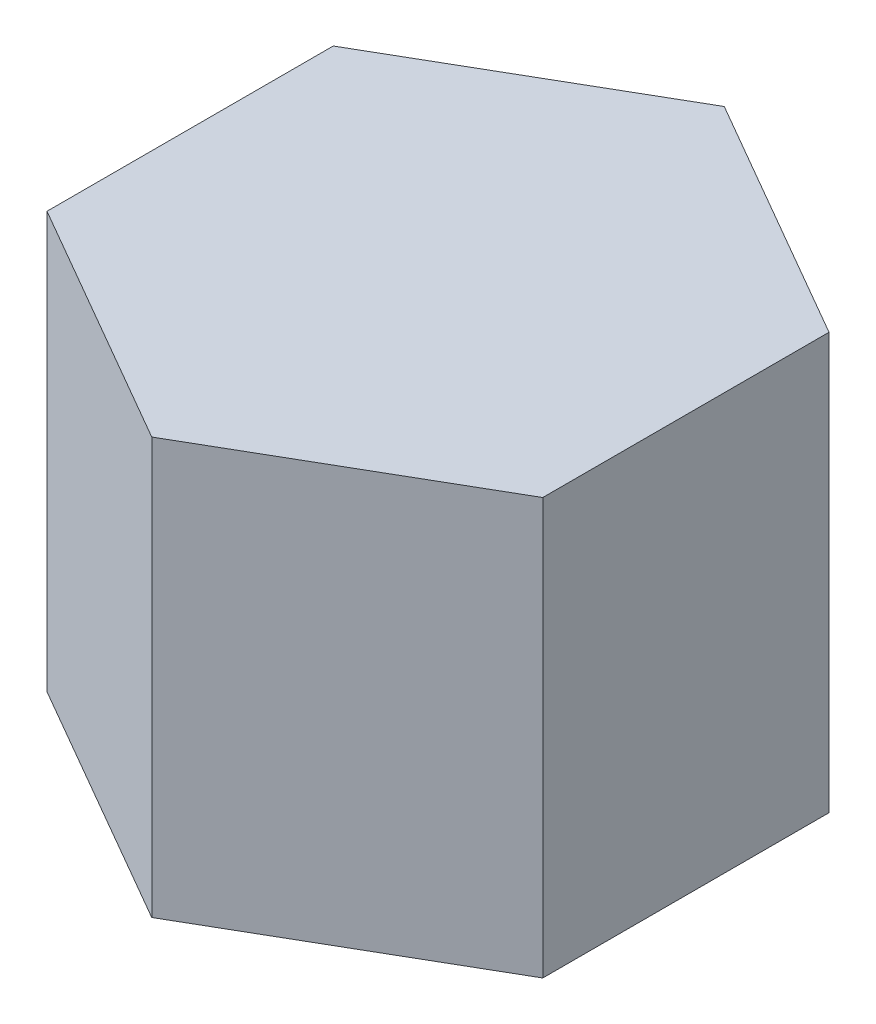
ISO-10303-21;
HEADER;
FILE_DESCRIPTION(('STEP AP214'),'2;1');
FILE_NAME('part.step','',(''),(''),'','','');
FILE_SCHEMA(('AUTOMOTIVE_DESIGN { 1 0 10303 214 1 1 1 1 }'));
ENDSEC;
DATA;
#1=APPLICATION_CONTEXT('core data for automotive mechanical design processes');
#2=APPLICATION_PROTOCOL_DEFINITION('international standard','automotive_design',2000,#1);
#3=PRODUCT_CONTEXT('',#1,'mechanical');
#4=PRODUCT('Part','Part','',(#3));
#5=PRODUCT_RELATED_PRODUCT_CATEGORY('part','',(#4));
#6=PRODUCT_DEFINITION_FORMATION('','',#4);
#7=PRODUCT_DEFINITION_CONTEXT('part definition',#1,'design');
#8=PRODUCT_DEFINITION('design','',#6,#7);
#9=PRODUCT_DEFINITION_SHAPE('','',#8);
#10=(LENGTH_UNIT() NAMED_UNIT(*) SI_UNIT(.MILLI.,.METRE.));
#11=(NAMED_UNIT(*) PLANE_ANGLE_UNIT() SI_UNIT($,.RADIAN.));
#12=(NAMED_UNIT(*) SI_UNIT($,.STERADIAN.) SOLID_ANGLE_UNIT());
#13=UNCERTAINTY_MEASURE_WITH_UNIT(LENGTH_MEASURE(1.E-05),#10,'distance_accuracy_value','');
#14=(GEOMETRIC_REPRESENTATION_CONTEXT(3) GLOBAL_UNCERTAINTY_ASSIGNED_CONTEXT((#13)) GLOBAL_UNIT_ASSIGNED_CONTEXT((#10,
#11,#12)) REPRESENTATION_CONTEXT('',''));
#15=CARTESIAN_POINT('',(0.,0.,0.));
#16=DIRECTION('',(0.,0.,1.));
#17=DIRECTION('',(1.,0.,0.));
#18=AXIS2_PLACEMENT_3D('',#15,#16,#17);
#19=CARTESIAN_POINT('',(205.339551417382,-147.556598747966,291.681971220494));
#20=DIRECTION('',(-0.500000000000096,0.,-0.866025403784383));
#21=DIRECTION('',(-0.866025403784383,0.,0.500000000000096));
#22=AXIS2_PLACEMENT_3D('',#19,#20,#21);
#23=PLANE('',#22);
#24=CARTESIAN_POINT('',(205.642660308706,-147.047793579175,291.506971220494));
#25=DIRECTION('',(-0.866025403784383,0.,0.500000000000096));
#26=VECTOR('',#25,1.);
#27=LINE('',#24,#26);
#28=CARTESIAN_POINT('',(205.642660308706,-147.047793579175,291.506971220494));
#29=VERTEX_POINT('',#28);
#30=CARTESIAN_POINT('',(205.339551417382,-147.047793579175,291.681971220494));
#31=VERTEX_POINT('',#30);
#32=EDGE_CURVE('E170',#29,#31,#27,.T.);
#33=ORIENTED_EDGE('',*,*,#32,.T.);
#34=CARTESIAN_POINT('',(205.339551417382,-147.556598747966,291.681971220494));
#35=DIRECTION('',(0.,1.,0.));
#36=VECTOR('',#35,1.);
#37=LINE('',#34,#36);
#38=CARTESIAN_POINT('',(205.339551417382,-147.556598747966,291.681971220494));
#39=VERTEX_POINT('',#38);
#40=EDGE_CURVE('E35',#39,#31,#37,.T.);
#41=ORIENTED_EDGE('',*,*,#40,.F.);
#42=CARTESIAN_POINT('',(205.642660308706,-147.556598747966,291.506971220494));
#43=DIRECTION('',(-0.866025403784383,0.,0.500000000000096));
#44=VECTOR('',#43,1.);
#45=LINE('',#42,#44);
#46=CARTESIAN_POINT('',(205.642660308706,-147.556598747966,291.506971220494));
#47=VERTEX_POINT('',#46);
#48=EDGE_CURVE('E159',#47,#39,#45,.T.);
#49=ORIENTED_EDGE('',*,*,#48,.F.);
#50=CARTESIAN_POINT('',(205.642660308706,-147.556598747966,291.506971220494));
#51=DIRECTION('',(0.,1.,0.));
#52=VECTOR('',#51,1.);
#53=LINE('',#50,#52);
#54=EDGE_CURVE('E10',#47,#29,#53,.T.);
#55=ORIENTED_EDGE('',*,*,#54,.T.);
#56=EDGE_LOOP('',(#33,#41,#49,#55));
#57=FACE_BOUND('',#56,.T.);
#58=ADVANCED_FACE('F16',(#57),#23,.F.);
#59=CARTESIAN_POINT('',(205.642660308706,-147.556598747966,291.594471220494));
#60=DIRECTION('',(-1.,0.,0.));
#61=DIRECTION('',(0.,-1.,0.));
#62=AXIS2_PLACEMENT_3D('',#59,#60,#61);
#63=PLANE('',#62);
#64=CARTESIAN_POINT('',(205.642660308706,-147.047793579175,291.156971220494));
#65=DIRECTION('',(0.,0.,1.));
#66=VECTOR('',#65,1.);
#67=LINE('',#64,#66);
#68=CARTESIAN_POINT('',(205.642660308706,-147.047793579175,291.156971220494));
#69=VERTEX_POINT('',#68);
#70=EDGE_CURVE('E167',#69,#29,#67,.T.);
#71=ORIENTED_EDGE('',*,*,#70,.T.);
#72=ORIENTED_EDGE('',*,*,#54,.F.);
#73=CARTESIAN_POINT('',(205.642660308706,-147.556598747966,291.156971220494));
#74=DIRECTION('',(0.,0.,1.));
#75=VECTOR('',#74,1.);
#76=LINE('',#73,#75);
#77=CARTESIAN_POINT('',(205.642660308706,-147.556598747966,291.156971220494));
#78=VERTEX_POINT('',#77);
#79=EDGE_CURVE('E156',#78,#47,#76,.T.);
#80=ORIENTED_EDGE('',*,*,#79,.F.);
#81=CARTESIAN_POINT('',(205.642660308706,-147.556598747966,291.156971220494));
#82=DIRECTION('',(0.,1.,0.));
#83=VECTOR('',#82,1.);
#84=LINE('',#81,#83);
#85=EDGE_CURVE('E27',#78,#69,#84,.T.);
#86=ORIENTED_EDGE('',*,*,#85,.T.);
#87=EDGE_LOOP('',(#71,#72,#80,#86));
#88=FACE_BOUND('',#87,.T.);
#89=ADVANCED_FACE('F189',(#88),#63,.F.);
#90=CARTESIAN_POINT('',(205.642660308706,-147.556598747966,291.156971220494));
#91=DIRECTION('',(-0.499999999999978,0.,0.866025403784452));
#92=DIRECTION('',(0.866025403784452,0.,0.499999999999978));
#93=AXIS2_PLACEMENT_3D('',#90,#91,#92);
#94=PLANE('',#93);
#95=CARTESIAN_POINT('',(205.339551417382,-147.047793579175,290.981971220494));
#96=DIRECTION('',(0.866025403784452,0.,0.499999999999978));
#97=VECTOR('',#96,1.);
#98=LINE('',#95,#97);
#99=CARTESIAN_POINT('',(205.339551417382,-147.047793579175,290.981971220494));
#100=VERTEX_POINT('',#99);
#101=EDGE_CURVE('E163',#100,#69,#98,.T.);
#102=ORIENTED_EDGE('',*,*,#101,.T.);
#103=ORIENTED_EDGE('',*,*,#85,.F.);
#104=CARTESIAN_POINT('',(205.339551417382,-147.556598747966,290.981971220494));
#105=DIRECTION('',(0.866025403784452,0.,0.499999999999978));
#106=VECTOR('',#105,1.);
#107=LINE('',#104,#106);
#108=CARTESIAN_POINT('',(205.339551417382,-147.556598747966,290.981971220494));
#109=VERTEX_POINT('',#108);
#110=EDGE_CURVE('E106',#109,#78,#107,.T.);
#111=ORIENTED_EDGE('',*,*,#110,.F.);
#112=CARTESIAN_POINT('',(205.339551417381,-147.556598747966,290.981971220494));
#113=DIRECTION('',(0.,1.,0.));
#114=VECTOR('',#113,1.);
#115=LINE('',#112,#114);
#116=EDGE_CURVE('E94',#109,#100,#115,.T.);
#117=ORIENTED_EDGE('',*,*,#116,.T.);
#118=EDGE_LOOP('',(#102,#103,#111,#117));
#119=FACE_BOUND('',#118,.T.);
#120=ADVANCED_FACE('F198',(#119),#94,.F.);
#121=CARTESIAN_POINT('',(205.339551417382,-147.556598747966,290.981971220494));
#122=DIRECTION('',(0.499999999999943,0.,0.866025403784471));
#123=DIRECTION('',(0.866025403784471,0.,-0.499999999999943));
#124=AXIS2_PLACEMENT_3D('',#121,#122,#123);
#125=PLANE('',#124);
#126=CARTESIAN_POINT('',(205.036442526057,-147.047793579175,291.156971220494));
#127=DIRECTION('',(0.866025403784471,0.,-0.499999999999943));
#128=VECTOR('',#127,1.);
#129=LINE('',#126,#128);
#130=CARTESIAN_POINT('',(205.036442526057,-147.047793579175,291.156971220494));
#131=VERTEX_POINT('',#130);
#132=EDGE_CURVE('E162',#131,#100,#129,.T.);
#133=ORIENTED_EDGE('',*,*,#132,.T.);
#134=ORIENTED_EDGE('',*,*,#116,.F.);
#135=CARTESIAN_POINT('',(205.036442526057,-147.556598747966,291.156971220494));
#136=DIRECTION('',(0.866025403784471,0.,-0.499999999999943));
#137=VECTOR('',#136,1.);
#138=LINE('',#135,#137);
#139=CARTESIAN_POINT('',(205.036442526057,-147.556598747966,291.156971220494));
#140=VERTEX_POINT('',#139);
#141=EDGE_CURVE('E98',#140,#109,#138,.T.);
#142=ORIENTED_EDGE('',*,*,#141,.F.);
#143=CARTESIAN_POINT('',(205.036442526057,-147.556598747966,291.156971220494));
#144=DIRECTION('',(0.,1.,0.));
#145=VECTOR('',#144,1.);
#146=LINE('',#143,#145);
#147=EDGE_CURVE('E79',#140,#131,#146,.T.);
#148=ORIENTED_EDGE('',*,*,#147,.T.);
#149=EDGE_LOOP('',(#133,#134,#142,#148));
#150=FACE_BOUND('',#149,.T.);
#151=ADVANCED_FACE('F100',(#150),#125,.F.);
#152=CARTESIAN_POINT('',(205.036442526057,-147.556598747966,291.594471220494));
#153=DIRECTION('',(1.,0.,0.));
#154=DIRECTION('',(0.,1.,0.));
#155=AXIS2_PLACEMENT_3D('',#152,#153,#154);
#156=PLANE('',#155);
#157=CARTESIAN_POINT('',(205.036442526057,-147.047793579175,291.506971220494));
#158=DIRECTION('',(0.,0.,-1.));
#159=VECTOR('',#158,1.);
#160=LINE('',#157,#159);
#161=CARTESIAN_POINT('',(205.036442526057,-147.047793579175,291.506971220494));
#162=VERTEX_POINT('',#161);
#163=EDGE_CURVE('E88',#162,#131,#160,.T.);
#164=ORIENTED_EDGE('',*,*,#163,.T.);
#165=ORIENTED_EDGE('',*,*,#147,.F.);
#166=CARTESIAN_POINT('',(205.036442526057,-147.556598747966,291.506971220494));
#167=DIRECTION('',(0.,0.,-1.));
#168=VECTOR('',#167,1.);
#169=LINE('',#166,#168);
#170=CARTESIAN_POINT('',(205.036442526057,-147.556598747966,291.506971220494));
#171=VERTEX_POINT('',#170);
#172=EDGE_CURVE('E84',#171,#140,#169,.T.);
#173=ORIENTED_EDGE('',*,*,#172,.F.);
#174=CARTESIAN_POINT('',(205.036442526057,-147.556598747966,291.506971220494));
#175=DIRECTION('',(0.,1.,0.));
#176=VECTOR('',#175,1.);
#177=LINE('',#174,#176);
#178=EDGE_CURVE('E58',#171,#162,#177,.T.);
#179=ORIENTED_EDGE('',*,*,#178,.T.);
#180=EDGE_LOOP('',(#164,#165,#173,#179));
#181=FACE_BOUND('',#180,.T.);
#182=ADVANCED_FACE('F82',(#181),#156,.F.);
#183=CARTESIAN_POINT('',(205.036442526057,-147.556598747966,291.506971220494));
#184=DIRECTION('',(0.500000000000062,0.,-0.866025403784403));
#185=DIRECTION('',(-0.866025403784403,0.,-0.500000000000062));
#186=AXIS2_PLACEMENT_3D('',#183,#184,#185);
#187=PLANE('',#186);
#188=CARTESIAN_POINT('',(205.339551417382,-147.047793579175,291.681971220494));
#189=DIRECTION('',(-0.866025403784403,0.,-0.500000000000062));
#190=VECTOR('',#189,1.);
#191=LINE('',#188,#190);
#192=EDGE_CURVE('E160',#31,#162,#191,.T.);
#193=ORIENTED_EDGE('',*,*,#192,.T.);
#194=ORIENTED_EDGE('',*,*,#178,.F.);
#195=CARTESIAN_POINT('',(205.339551417382,-147.556598747966,291.681971220494));
#196=DIRECTION('',(-0.866025403784403,0.,-0.500000000000062));
#197=VECTOR('',#196,1.);
#198=LINE('',#195,#197);
#199=EDGE_CURVE('E112',#39,#171,#198,.T.);
#200=ORIENTED_EDGE('',*,*,#199,.F.);
#201=ORIENTED_EDGE('',*,*,#40,.T.);
#202=EDGE_LOOP('',(#193,#194,#200,#201));
#203=FACE_BOUND('',#202,.T.);
#204=ADVANCED_FACE('F131',(#203),#187,.F.);
#205=CARTESIAN_POINT('',(206.491105863044,-147.556598747966,291.594471220494));
#206=DIRECTION('',(0.,1.,0.));
#207=DIRECTION('',(-1.,0.,0.));
#208=AXIS2_PLACEMENT_3D('',#205,#206,#207);
#209=PLANE('',#208);
#210=ORIENTED_EDGE('',*,*,#48,.T.);
#211=ORIENTED_EDGE('',*,*,#199,.T.);
#212=ORIENTED_EDGE('',*,*,#172,.T.);
#213=ORIENTED_EDGE('',*,*,#141,.T.);
#214=ORIENTED_EDGE('',*,*,#110,.T.);
#215=ORIENTED_EDGE('',*,*,#79,.T.);
#216=EDGE_LOOP('',(#210,#211,#212,#213,#214,#215));
#217=FACE_BOUND('',#216,.T.);
#218=ADVANCED_FACE('F111',(#217),#209,.F.);
#219=CARTESIAN_POINT('',(206.491105863044,-147.047793579175,291.594471220494));
#220=DIRECTION('',(0.,1.,0.));
#221=DIRECTION('',(-1.,0.,0.));
#222=AXIS2_PLACEMENT_3D('',#219,#220,#221);
#223=PLANE('',#222);
#224=ORIENTED_EDGE('',*,*,#32,.F.);
#225=ORIENTED_EDGE('',*,*,#70,.F.);
#226=ORIENTED_EDGE('',*,*,#101,.F.);
#227=ORIENTED_EDGE('',*,*,#132,.F.);
#228=ORIENTED_EDGE('',*,*,#163,.F.);
#229=ORIENTED_EDGE('',*,*,#192,.F.);
#230=EDGE_LOOP('',(#224,#225,#226,#227,#228,#229));
#231=FACE_BOUND('',#230,.T.);
#232=ADVANCED_FACE('F130',(#231),#223,.T.);
#233=CLOSED_SHELL('',(#58,#89,#120,#151,#182,#204,#218,#232));
#234=MANIFOLD_SOLID_BREP('B1',#233);
#235=ADVANCED_BREP_SHAPE_REPRESENTATION('',(#18,#234),#14);
#236=SHAPE_DEFINITION_REPRESENTATION(#9,#235);
ENDSEC;
END-ISO-10303-21;
